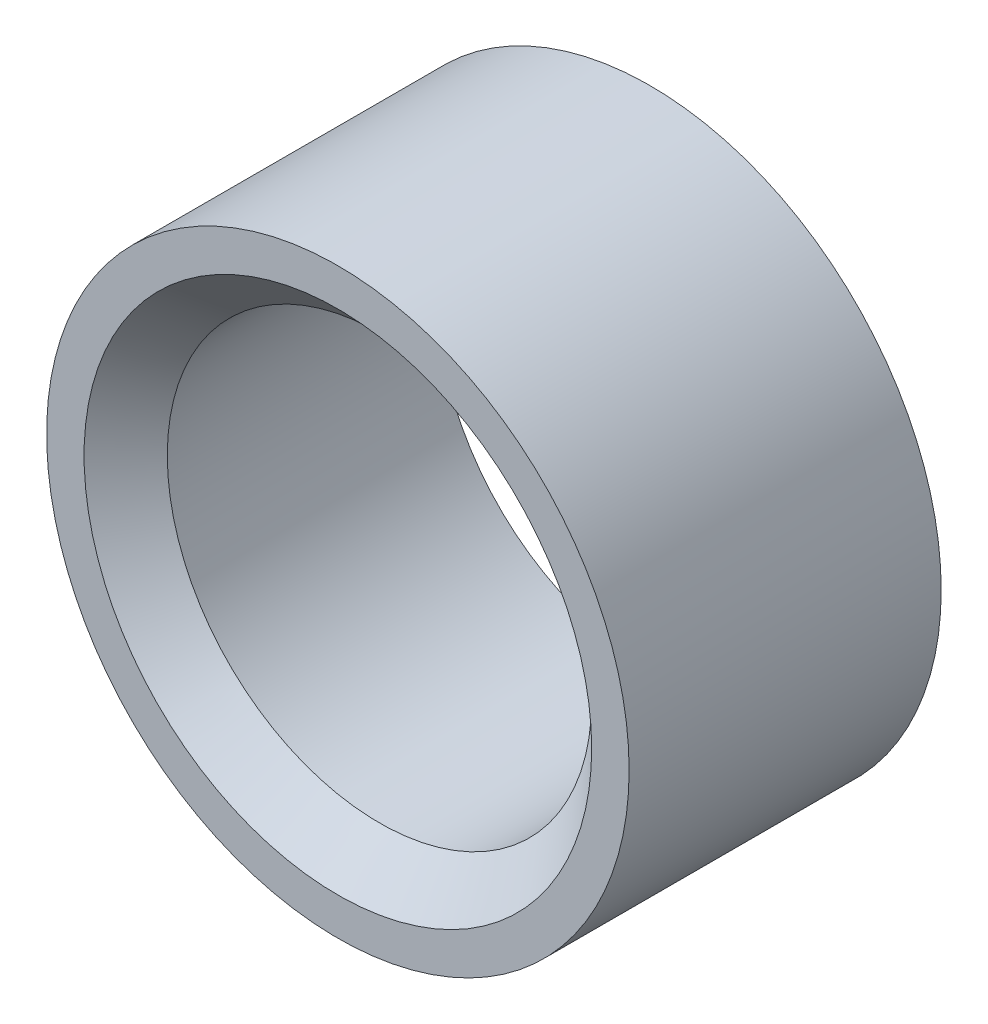
ISO-10303-21;
HEADER;
FILE_DESCRIPTION(('STEP AP214'),'2;1');
FILE_NAME('part.step','',(''),(''),'','','');
FILE_SCHEMA(('AUTOMOTIVE_DESIGN { 1 0 10303 214 1 1 1 1 }'));
ENDSEC;
DATA;
#1=APPLICATION_CONTEXT('core data for automotive mechanical design processes');
#2=APPLICATION_PROTOCOL_DEFINITION('international standard','automotive_design',2000,#1);
#3=PRODUCT_CONTEXT('',#1,'mechanical');
#4=PRODUCT('Part','Part','',(#3));
#5=PRODUCT_RELATED_PRODUCT_CATEGORY('part','',(#4));
#6=PRODUCT_DEFINITION_FORMATION('','',#4);
#7=PRODUCT_DEFINITION_CONTEXT('part definition',#1,'design');
#8=PRODUCT_DEFINITION('design','',#6,#7);
#9=PRODUCT_DEFINITION_SHAPE('','',#8);
#10=(LENGTH_UNIT() NAMED_UNIT(*) SI_UNIT(.MILLI.,.METRE.));
#11=(NAMED_UNIT(*) PLANE_ANGLE_UNIT() SI_UNIT($,.RADIAN.));
#12=(NAMED_UNIT(*) SI_UNIT($,.STERADIAN.) SOLID_ANGLE_UNIT());
#13=UNCERTAINTY_MEASURE_WITH_UNIT(LENGTH_MEASURE(1.E-05),#10,'distance_accuracy_value','');
#14=(GEOMETRIC_REPRESENTATION_CONTEXT(3) GLOBAL_UNCERTAINTY_ASSIGNED_CONTEXT((#13)) GLOBAL_UNIT_ASSIGNED_CONTEXT((#10,
#11,#12)) REPRESENTATION_CONTEXT('',''));
#15=CARTESIAN_POINT('',(0.,0.,0.));
#16=DIRECTION('',(0.,0.,1.));
#17=DIRECTION('',(1.,0.,0.));
#18=AXIS2_PLACEMENT_3D('',#15,#16,#17);
#19=CARTESIAN_POINT('',(0.,0.,15.));
#20=DIRECTION('',(0.,0.,1.));
#21=DIRECTION('',(1.,0.,0.));
#22=AXIS2_PLACEMENT_3D('',#19,#20,#21);
#23=PLANE('',#22);
#24=CARTESIAN_POINT('',(0.,0.,15.));
#25=DIRECTION('',(0.,0.,1.));
#26=DIRECTION('',(1.,0.,0.));
#27=AXIS2_PLACEMENT_3D('',#24,#25,#26);
#28=CIRCLE('',#27,12.2);
#29=CARTESIAN_POINT('',(12.2,0.,15.));
#30=VERTEX_POINT('',#29);
#31=EDGE_CURVE('E10',#30,#30,#28,.F.);
#32=ORIENTED_EDGE('',*,*,#31,.T.);
#33=EDGE_LOOP('',(#32));
#34=FACE_BOUND('',#33,.T.);
#35=CARTESIAN_POINT('',(0.,0.,15.));
#36=DIRECTION('',(0.,0.,1.));
#37=DIRECTION('',(1.,0.,0.));
#38=AXIS2_PLACEMENT_3D('',#35,#36,#37);
#39=CIRCLE('',#38,14.);
#40=CARTESIAN_POINT('',(14.,0.,15.));
#41=VERTEX_POINT('',#40);
#42=EDGE_CURVE('E48',#41,#41,#39,.T.);
#43=ORIENTED_EDGE('',*,*,#42,.T.);
#44=EDGE_LOOP('',(#43));
#45=FACE_BOUND('',#44,.T.);
#46=ADVANCED_FACE('F36',(#34,#45),#23,.T.);
#47=CARTESIAN_POINT('',(0.,0.,0.));
#48=DIRECTION('',(0.,0.,1.));
#49=DIRECTION('',(1.,0.,0.));
#50=AXIS2_PLACEMENT_3D('',#47,#48,#49);
#51=PLANE('',#50);
#52=CARTESIAN_POINT('',(0.,0.,0.));
#53=DIRECTION('',(0.,0.,1.));
#54=DIRECTION('',(1.,0.,0.));
#55=AXIS2_PLACEMENT_3D('',#52,#53,#54);
#56=CIRCLE('',#55,14.);
#57=CARTESIAN_POINT('',(14.,0.,0.));
#58=VERTEX_POINT('',#57);
#59=EDGE_CURVE('E52',#58,#58,#56,.T.);
#60=ORIENTED_EDGE('',*,*,#59,.F.);
#61=EDGE_LOOP('',(#60));
#62=FACE_BOUND('',#61,.T.);
#63=CARTESIAN_POINT('',(0.,0.,0.));
#64=DIRECTION('',(0.,0.,1.));
#65=DIRECTION('',(1.,0.,0.));
#66=AXIS2_PLACEMENT_3D('',#63,#64,#65);
#67=CIRCLE('',#66,10.2);
#68=CARTESIAN_POINT('',(10.2,0.,0.));
#69=VERTEX_POINT('',#68);
#70=EDGE_CURVE('E56',#69,#69,#67,.T.);
#71=ORIENTED_EDGE('',*,*,#70,.T.);
#72=EDGE_LOOP('',(#71));
#73=FACE_BOUND('',#72,.T.);
#74=ADVANCED_FACE('F61',(#62,#73),#51,.F.);
#75=CARTESIAN_POINT('',(0.,0.,15.));
#76=DIRECTION('',(0.,0.,-1.));
#77=DIRECTION('',(-1.,0.,0.));
#78=AXIS2_PLACEMENT_3D('',#75,#76,#77);
#79=CYLINDRICAL_SURFACE('',#78,14.);
#80=ORIENTED_EDGE('',*,*,#42,.F.);
#81=EDGE_LOOP('',(#80));
#82=FACE_BOUND('',#81,.T.);
#83=ORIENTED_EDGE('',*,*,#59,.T.);
#84=EDGE_LOOP('',(#83));
#85=FACE_BOUND('',#84,.T.);
#86=ADVANCED_FACE('F65',(#82,#85),#79,.T.);
#87=CARTESIAN_POINT('',(0.,0.,15.));
#88=DIRECTION('',(0.,0.,-1.));
#89=DIRECTION('',(-1.,0.,0.));
#90=AXIS2_PLACEMENT_3D('',#87,#88,#89);
#91=CYLINDRICAL_SURFACE('',#90,10.2);
#92=CARTESIAN_POINT('',(0.,0.,13.));
#93=DIRECTION('',(0.,0.,1.));
#94=DIRECTION('',(1.,0.,0.));
#95=AXIS2_PLACEMENT_3D('',#92,#93,#94);
#96=CIRCLE('',#95,10.2);
#97=CARTESIAN_POINT('',(10.2,0.,13.));
#98=VERTEX_POINT('',#97);
#99=EDGE_CURVE('E44',#98,#98,#96,.T.);
#100=ORIENTED_EDGE('',*,*,#99,.T.);
#101=EDGE_LOOP('',(#100));
#102=FACE_BOUND('',#101,.T.);
#103=ORIENTED_EDGE('',*,*,#70,.F.);
#104=EDGE_LOOP('',(#103));
#105=FACE_BOUND('',#104,.T.);
#106=ADVANCED_FACE('F63',(#102,#105),#91,.F.);
#107=CARTESIAN_POINT('',(0.,0.,13.));
#108=DIRECTION('',(0.,0.,1.));
#109=DIRECTION('',(1.,0.,0.));
#110=AXIS2_PLACEMENT_3D('',#107,#108,#109);
#111=CONICAL_SURFACE('',#110,10.2,0.785398163397451);
#112=ORIENTED_EDGE('',*,*,#31,.F.);
#113=EDGE_LOOP('',(#112));
#114=FACE_BOUND('',#113,.T.);
#115=ORIENTED_EDGE('',*,*,#99,.F.);
#116=EDGE_LOOP('',(#115));
#117=FACE_BOUND('',#116,.T.);
#118=ADVANCED_FACE('F39',(#114,#117),#111,.F.);
#119=CLOSED_SHELL('',(#46,#74,#86,#106,#118));
#120=MANIFOLD_SOLID_BREP('B2',#119);
#121=ADVANCED_BREP_SHAPE_REPRESENTATION('',(#18,#120),#14);
#122=SHAPE_DEFINITION_REPRESENTATION(#9,#121);
ENDSEC;
END-ISO-10303-21;
